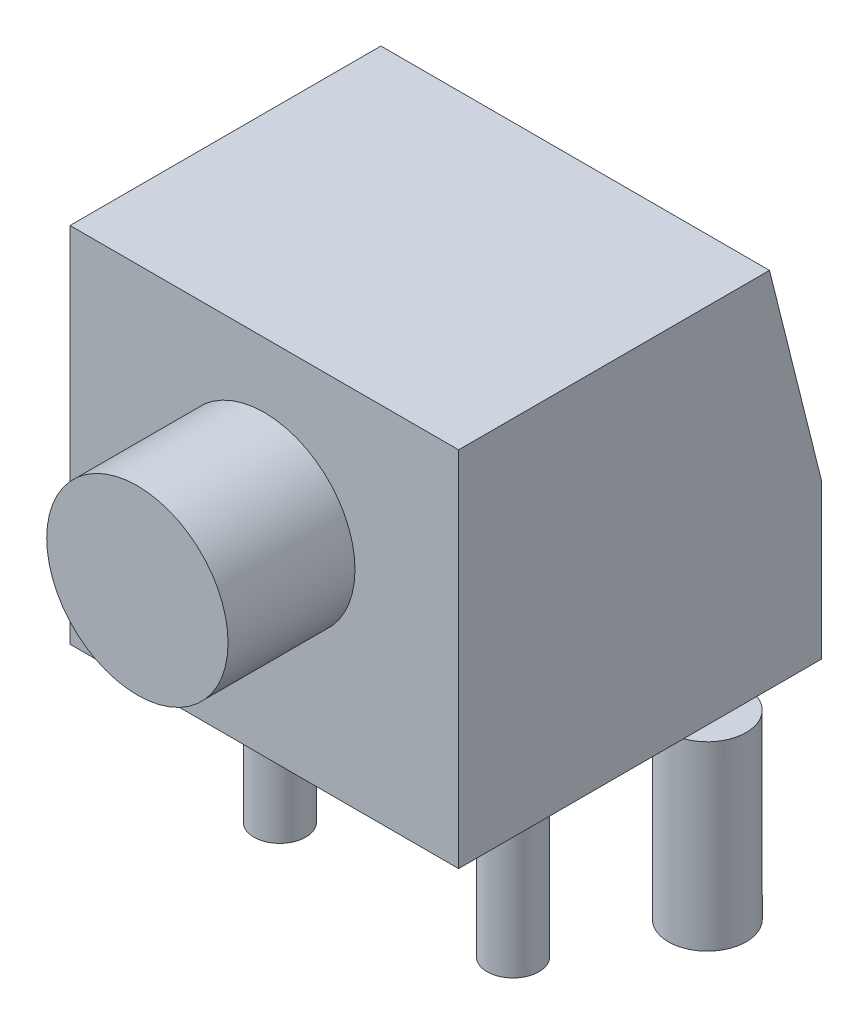
ISO-10303-21;
HEADER;
FILE_DESCRIPTION(('STEP AP214'),'2;1');
FILE_NAME('part.step','',(''),(''),'','','');
FILE_SCHEMA(('AUTOMOTIVE_DESIGN { 1 0 10303 214 1 1 1 1 }'));
ENDSEC;
DATA;
#1=APPLICATION_CONTEXT('core data for automotive mechanical design processes');
#2=APPLICATION_PROTOCOL_DEFINITION('international standard','automotive_design',2000,#1);
#3=PRODUCT_CONTEXT('',#1,'mechanical');
#4=PRODUCT('Part','Part','',(#3));
#5=PRODUCT_RELATED_PRODUCT_CATEGORY('part','',(#4));
#6=PRODUCT_DEFINITION_FORMATION('','',#4);
#7=PRODUCT_DEFINITION_CONTEXT('part definition',#1,'design');
#8=PRODUCT_DEFINITION('design','',#6,#7);
#9=PRODUCT_DEFINITION_SHAPE('','',#8);
#10=(LENGTH_UNIT() NAMED_UNIT(*) SI_UNIT(.MILLI.,.METRE.));
#11=(NAMED_UNIT(*) PLANE_ANGLE_UNIT() SI_UNIT($,.RADIAN.));
#12=(NAMED_UNIT(*) SI_UNIT($,.STERADIAN.) SOLID_ANGLE_UNIT());
#13=UNCERTAINTY_MEASURE_WITH_UNIT(LENGTH_MEASURE(1.E-05),#10,'distance_accuracy_value','');
#14=(GEOMETRIC_REPRESENTATION_CONTEXT(3) GLOBAL_UNCERTAINTY_ASSIGNED_CONTEXT((#13)) GLOBAL_UNIT_ASSIGNED_CONTEXT((#10,
#11,#12)) REPRESENTATION_CONTEXT('',''));
#15=CARTESIAN_POINT('',(0.,0.,0.));
#16=DIRECTION('',(0.,0.,1.));
#17=DIRECTION('',(1.,0.,0.));
#18=AXIS2_PLACEMENT_3D('',#15,#16,#17);
#19=CARTESIAN_POINT('',(3.75,0.,2.55));
#20=DIRECTION('',(0.,0.,-1.));
#21=DIRECTION('',(-1.,0.,0.));
#22=AXIS2_PLACEMENT_3D('',#19,#20,#21);
#23=PLANE('',#22);
#24=CARTESIAN_POINT('',(0.,4.,2.55));
#25=DIRECTION('',(0.,0.,1.));
#26=DIRECTION('',(1.,0.,0.));
#27=AXIS2_PLACEMENT_3D('',#24,#25,#26);
#28=CIRCLE('',#27,1.75);
#29=CARTESIAN_POINT('',(1.75,4.,2.55));
#30=VERTEX_POINT('',#29);
#31=EDGE_CURVE('E12',#30,#30,#28,.T.);
#32=ORIENTED_EDGE('',*,*,#31,.F.);
#33=EDGE_LOOP('',(#32));
#34=FACE_BOUND('',#33,.T.);
#35=DIRECTION('',(0.,-1.,0.));
#36=VECTOR('',#35,1.);
#37=CARTESIAN_POINT('',(-3.75,0.,2.55));
#38=LINE('',#37,#36);
#39=CARTESIAN_POINT('',(-3.75,7.,2.55));
#40=VERTEX_POINT('',#39);
#41=CARTESIAN_POINT('',(-3.75,0.,2.55));
#42=VERTEX_POINT('',#41);
#43=EDGE_CURVE('E132',#40,#42,#38,.T.);
#44=ORIENTED_EDGE('',*,*,#43,.T.);
#45=DIRECTION('',(-1.,0.,0.));
#46=VECTOR('',#45,1.);
#47=CARTESIAN_POINT('',(3.75,0.,2.55));
#48=LINE('',#47,#46);
#49=CARTESIAN_POINT('',(3.75,0.,2.55));
#50=VERTEX_POINT('',#49);
#51=EDGE_CURVE('E168',#50,#42,#48,.T.);
#52=ORIENTED_EDGE('',*,*,#51,.F.);
#53=DIRECTION('',(0.,-1.,0.));
#54=VECTOR('',#53,1.);
#55=CARTESIAN_POINT('',(3.75,0.,2.55));
#56=LINE('',#55,#54);
#57=CARTESIAN_POINT('',(3.75,7.,2.55));
#58=VERTEX_POINT('',#57);
#59=EDGE_CURVE('E115',#58,#50,#56,.T.);
#60=ORIENTED_EDGE('',*,*,#59,.F.);
#61=DIRECTION('',(-1.,0.,0.));
#62=VECTOR('',#61,1.);
#63=CARTESIAN_POINT('',(3.75,7.,2.55));
#64=LINE('',#63,#62);
#65=EDGE_CURVE('E170',#58,#40,#64,.T.);
#66=ORIENTED_EDGE('',*,*,#65,.T.);
#67=EDGE_LOOP('',(#44,#52,#60,#66));
#68=FACE_BOUND('',#67,.T.);
#69=ADVANCED_FACE('F36',(#34,#68),#23,.F.);
#70=CARTESIAN_POINT('',(3.75,0.,2.55));
#71=DIRECTION('',(0.,1.,0.));
#72=DIRECTION('',(0.,0.,1.));
#73=AXIS2_PLACEMENT_3D('',#70,#71,#72);
#74=PLANE('',#73);
#75=CARTESIAN_POINT('',(3.5,0.,-2.5));
#76=DIRECTION('',(0.,-1.,0.));
#77=DIRECTION('',(0.,0.,1.));
#78=AXIS2_PLACEMENT_3D('',#75,#76,#77);
#79=CIRCLE('',#78,0.75);
#80=CARTESIAN_POINT('',(3.75,0.,-1.79289321881345));
#81=VERTEX_POINT('',#80);
#82=CARTESIAN_POINT('',(3.75,0.,-3.20710678118655));
#83=VERTEX_POINT('',#82);
#84=EDGE_CURVE('E103',#81,#83,#79,.T.);
#85=ORIENTED_EDGE('',*,*,#84,.F.);
#86=DIRECTION('',(0.,0.,-1.));
#87=VECTOR('',#86,1.);
#88=CARTESIAN_POINT('',(3.75,0.,2.55));
#89=LINE('',#88,#87);
#90=EDGE_CURVE('E97',#50,#81,#89,.T.);
#91=ORIENTED_EDGE('',*,*,#90,.F.);
#92=ORIENTED_EDGE('',*,*,#51,.T.);
#93=DIRECTION('',(0.,0.,-1.));
#94=VECTOR('',#93,1.);
#95=CARTESIAN_POINT('',(-3.75,0.,2.55));
#96=LINE('',#95,#94);
#97=CARTESIAN_POINT('',(-3.75,0.,-1.79289321881345));
#98=VERTEX_POINT('',#97);
#99=EDGE_CURVE('E177',#42,#98,#96,.T.);
#100=ORIENTED_EDGE('',*,*,#99,.T.);
#101=CARTESIAN_POINT('',(-3.5,0.,-2.5));
#102=DIRECTION('',(0.,-1.,0.));
#103=DIRECTION('',(0.,0.,-1.));
#104=AXIS2_PLACEMENT_3D('',#101,#102,#103);
#105=CIRCLE('',#104,0.75);
#106=CARTESIAN_POINT('',(-3.75,0.,-3.20710678118655));
#107=VERTEX_POINT('',#106);
#108=EDGE_CURVE('E58',#107,#98,#105,.T.);
#109=ORIENTED_EDGE('',*,*,#108,.F.);
#110=CARTESIAN_POINT('',(-3.75,0.,-4.45));
#111=VERTEX_POINT('',#110);
#112=EDGE_CURVE('E173',#107,#111,#96,.T.);
#113=ORIENTED_EDGE('',*,*,#112,.T.);
#114=DIRECTION('',(-1.,0.,0.));
#115=VECTOR('',#114,1.);
#116=CARTESIAN_POINT('',(3.75,0.,-4.45));
#117=LINE('',#116,#115);
#118=CARTESIAN_POINT('',(3.75,0.,-4.45));
#119=VERTEX_POINT('',#118);
#120=EDGE_CURVE('E192',#119,#111,#117,.T.);
#121=ORIENTED_EDGE('',*,*,#120,.F.);
#122=EDGE_CURVE('E98',#83,#119,#89,.T.);
#123=ORIENTED_EDGE('',*,*,#122,.F.);
#124=EDGE_LOOP('',(#85,#91,#92,#100,#109,#113,#121,#123));
#125=FACE_BOUND('',#124,.T.);
#126=CARTESIAN_POINT('',(2.25,0.,0.));
#127=DIRECTION('',(0.,1.,0.));
#128=DIRECTION('',(0.,0.,1.));
#129=AXIS2_PLACEMENT_3D('',#126,#127,#128);
#130=CIRCLE('',#129,0.5);
#131=CARTESIAN_POINT('',(2.25,0.,0.5));
#132=VERTEX_POINT('',#131);
#133=EDGE_CURVE('E39',#132,#132,#130,.F.);
#134=ORIENTED_EDGE('',*,*,#133,.F.);
#135=EDGE_LOOP('',(#134));
#136=FACE_BOUND('',#135,.T.);
#137=CARTESIAN_POINT('',(-2.25,0.,0.));
#138=DIRECTION('',(0.,1.,0.));
#139=DIRECTION('',(0.,0.,1.));
#140=AXIS2_PLACEMENT_3D('',#137,#138,#139);
#141=CIRCLE('',#140,0.5);
#142=CARTESIAN_POINT('',(-2.25,0.,0.5));
#143=VERTEX_POINT('',#142);
#144=EDGE_CURVE('E195',#143,#143,#141,.F.);
#145=ORIENTED_EDGE('',*,*,#144,.F.);
#146=EDGE_LOOP('',(#145));
#147=FACE_BOUND('',#146,.T.);
#148=ADVANCED_FACE('F107',(#125,#136,#147),#74,.F.);
#149=CARTESIAN_POINT('',(3.75,0.,-4.45));
#150=DIRECTION('',(0.,0.,1.));
#151=DIRECTION('',(1.,0.,0.));
#152=AXIS2_PLACEMENT_3D('',#149,#150,#151);
#153=PLANE('',#152);
#154=DIRECTION('',(0.,1.,0.));
#155=VECTOR('',#154,1.);
#156=CARTESIAN_POINT('',(-3.75,0.,-4.45));
#157=LINE('',#156,#155);
#158=CARTESIAN_POINT('',(-3.75,3.,-4.45));
#159=VERTEX_POINT('',#158);
#160=EDGE_CURVE('E182',#111,#159,#157,.T.);
#161=ORIENTED_EDGE('',*,*,#160,.T.);
#162=DIRECTION('',(-1.,0.,0.));
#163=VECTOR('',#162,1.);
#164=CARTESIAN_POINT('',(3.75,3.,-4.45));
#165=LINE('',#164,#163);
#166=CARTESIAN_POINT('',(3.75,3.,-4.45));
#167=VERTEX_POINT('',#166);
#168=EDGE_CURVE('E189',#167,#159,#165,.T.);
#169=ORIENTED_EDGE('',*,*,#168,.F.);
#170=DIRECTION('',(0.,1.,0.));
#171=VECTOR('',#170,1.);
#172=CARTESIAN_POINT('',(3.75,0.,-4.45));
#173=LINE('',#172,#171);
#174=EDGE_CURVE('E117',#119,#167,#173,.T.);
#175=ORIENTED_EDGE('',*,*,#174,.F.);
#176=ORIENTED_EDGE('',*,*,#120,.T.);
#177=EDGE_LOOP('',(#161,#169,#175,#176));
#178=FACE_BOUND('',#177,.T.);
#179=ADVANCED_FACE('F162',(#178),#153,.F.);
#180=CARTESIAN_POINT('',(3.75,3.,-4.45));
#181=DIRECTION('',(0.,-0.242535625036333,0.970142500145332));
#182=DIRECTION('',(0.,-0.970142500145332,-0.242535625036333));
#183=AXIS2_PLACEMENT_3D('',#180,#181,#182);
#184=PLANE('',#183);
#185=DIRECTION('',(0.,0.970142500145332,0.242535625036333));
#186=VECTOR('',#185,1.);
#187=CARTESIAN_POINT('',(-3.75,3.,-4.45));
#188=LINE('',#187,#186);
#189=CARTESIAN_POINT('',(-3.75,7.,-3.45));
#190=VERTEX_POINT('',#189);
#191=EDGE_CURVE('E122',#159,#190,#188,.T.);
#192=ORIENTED_EDGE('',*,*,#191,.T.);
#193=DIRECTION('',(-1.,0.,0.));
#194=VECTOR('',#193,1.);
#195=CARTESIAN_POINT('',(3.75,7.,-3.45));
#196=LINE('',#195,#194);
#197=CARTESIAN_POINT('',(3.75,7.,-3.45));
#198=VERTEX_POINT('',#197);
#199=EDGE_CURVE('E186',#198,#190,#196,.T.);
#200=ORIENTED_EDGE('',*,*,#199,.F.);
#201=DIRECTION('',(0.,0.970142500145332,0.242535625036333));
#202=VECTOR('',#201,1.);
#203=CARTESIAN_POINT('',(3.75,3.,-4.45));
#204=LINE('',#203,#202);
#205=EDGE_CURVE('E118',#167,#198,#204,.T.);
#206=ORIENTED_EDGE('',*,*,#205,.F.);
#207=ORIENTED_EDGE('',*,*,#168,.T.);
#208=EDGE_LOOP('',(#192,#200,#206,#207));
#209=FACE_BOUND('',#208,.T.);
#210=ADVANCED_FACE('F217',(#209),#184,.F.);
#211=CARTESIAN_POINT('',(3.75,7.,2.55));
#212=DIRECTION('',(0.,-1.,0.));
#213=DIRECTION('',(0.,0.,-1.));
#214=AXIS2_PLACEMENT_3D('',#211,#212,#213);
#215=PLANE('',#214);
#216=DIRECTION('',(0.,0.,1.));
#217=VECTOR('',#216,1.);
#218=CARTESIAN_POINT('',(-3.75,7.,2.55));
#219=LINE('',#218,#217);
#220=EDGE_CURVE('E121',#190,#40,#219,.T.);
#221=ORIENTED_EDGE('',*,*,#220,.T.);
#222=ORIENTED_EDGE('',*,*,#65,.F.);
#223=DIRECTION('',(0.,0.,1.));
#224=VECTOR('',#223,1.);
#225=CARTESIAN_POINT('',(3.75,7.,2.55));
#226=LINE('',#225,#224);
#227=EDGE_CURVE('E179',#198,#58,#226,.T.);
#228=ORIENTED_EDGE('',*,*,#227,.F.);
#229=ORIENTED_EDGE('',*,*,#199,.T.);
#230=EDGE_LOOP('',(#221,#222,#228,#229));
#231=FACE_BOUND('',#230,.T.);
#232=ADVANCED_FACE('F219',(#231),#215,.F.);
#233=CARTESIAN_POINT('',(3.75,0.,0.));
#234=DIRECTION('',(-1.,0.,0.));
#235=DIRECTION('',(0.,0.,1.));
#236=AXIS2_PLACEMENT_3D('',#233,#234,#235);
#237=PLANE('',#236);
#238=ORIENTED_EDGE('',*,*,#59,.T.);
#239=ORIENTED_EDGE('',*,*,#90,.T.);
#240=EDGE_CURVE('E93',#81,#83,#89,.T.);
#241=ORIENTED_EDGE('',*,*,#240,.T.);
#242=ORIENTED_EDGE('',*,*,#122,.T.);
#243=ORIENTED_EDGE('',*,*,#174,.T.);
#244=ORIENTED_EDGE('',*,*,#205,.T.);
#245=ORIENTED_EDGE('',*,*,#227,.T.);
#246=EDGE_LOOP('',(#238,#239,#241,#242,#243,#244,#245));
#247=FACE_BOUND('',#246,.T.);
#248=ADVANCED_FACE('F113',(#247),#237,.F.);
#249=CARTESIAN_POINT('',(-3.75,0.,0.));
#250=DIRECTION('',(-1.,0.,0.));
#251=DIRECTION('',(0.,0.,1.));
#252=AXIS2_PLACEMENT_3D('',#249,#250,#251);
#253=PLANE('',#252);
#254=ORIENTED_EDGE('',*,*,#43,.F.);
#255=ORIENTED_EDGE('',*,*,#220,.F.);
#256=ORIENTED_EDGE('',*,*,#191,.F.);
#257=ORIENTED_EDGE('',*,*,#160,.F.);
#258=ORIENTED_EDGE('',*,*,#112,.F.);
#259=EDGE_CURVE('E175',#98,#107,#96,.T.);
#260=ORIENTED_EDGE('',*,*,#259,.F.);
#261=ORIENTED_EDGE('',*,*,#99,.F.);
#262=EDGE_LOOP('',(#254,#255,#256,#257,#258,#260,#261));
#263=FACE_BOUND('',#262,.T.);
#264=ADVANCED_FACE('F207',(#263),#253,.T.);
#265=CARTESIAN_POINT('',(-3.5,0.,-2.5));
#266=DIRECTION('',(0.,-1.,0.));
#267=DIRECTION('',(0.,0.,-1.));
#268=AXIS2_PLACEMENT_3D('',#265,#266,#267);
#269=PLANE('',#268);
#270=EDGE_CURVE('E125',#98,#107,#105,.T.);
#271=ORIENTED_EDGE('',*,*,#270,.F.);
#272=ORIENTED_EDGE('',*,*,#259,.T.);
#273=EDGE_LOOP('',(#271,#272));
#274=FACE_BOUND('',#273,.T.);
#275=ADVANCED_FACE('F205',(#274),#269,.F.);
#276=CARTESIAN_POINT('',(-3.5,-3.5,-2.5));
#277=DIRECTION('',(0.,1.,0.));
#278=DIRECTION('',(0.,0.,1.));
#279=AXIS2_PLACEMENT_3D('',#276,#277,#278);
#280=CYLINDRICAL_SURFACE('',#279,0.75);
#281=CARTESIAN_POINT('',(-3.5,-3.5,-2.5));
#282=DIRECTION('',(0.,-1.,0.));
#283=DIRECTION('',(0.,0.,-1.));
#284=AXIS2_PLACEMENT_3D('',#281,#282,#283);
#285=CIRCLE('',#284,0.75);
#286=CARTESIAN_POINT('',(-3.5,-3.5,-3.25));
#287=VERTEX_POINT('',#286);
#288=EDGE_CURVE('E128',#287,#287,#285,.T.);
#289=ORIENTED_EDGE('',*,*,#288,.F.);
#290=EDGE_LOOP('',(#289));
#291=FACE_BOUND('',#290,.T.);
#292=ORIENTED_EDGE('',*,*,#270,.T.);
#293=ORIENTED_EDGE('',*,*,#108,.T.);
#294=EDGE_LOOP('',(#292,#293));
#295=FACE_BOUND('',#294,.T.);
#296=ADVANCED_FACE('F202',(#291,#295),#280,.T.);
#297=CARTESIAN_POINT('',(-3.5,-3.5,-2.5));
#298=DIRECTION('',(0.,-1.,0.));
#299=DIRECTION('',(0.,0.,-1.));
#300=AXIS2_PLACEMENT_3D('',#297,#298,#299);
#301=PLANE('',#300);
#302=ORIENTED_EDGE('',*,*,#288,.T.);
#303=EDGE_LOOP('',(#302));
#304=FACE_BOUND('',#303,.T.);
#305=ADVANCED_FACE('F278',(#304),#301,.T.);
#306=CARTESIAN_POINT('',(-2.25,-3.5,0.));
#307=DIRECTION('',(0.,1.,0.));
#308=DIRECTION('',(0.,0.,1.));
#309=AXIS2_PLACEMENT_3D('',#306,#307,#308);
#310=CYLINDRICAL_SURFACE('',#309,0.5);
#311=CARTESIAN_POINT('',(-2.25,-3.5,0.));
#312=DIRECTION('',(0.,-1.,0.));
#313=DIRECTION('',(0.,0.,-1.));
#314=AXIS2_PLACEMENT_3D('',#311,#312,#313);
#315=CIRCLE('',#314,0.5);
#316=CARTESIAN_POINT('',(-2.25,-3.5,-0.5));
#317=VERTEX_POINT('',#316);
#318=EDGE_CURVE('E129',#317,#317,#315,.T.);
#319=ORIENTED_EDGE('',*,*,#318,.F.);
#320=EDGE_LOOP('',(#319));
#321=FACE_BOUND('',#320,.T.);
#322=ORIENTED_EDGE('',*,*,#144,.T.);
#323=EDGE_LOOP('',(#322));
#324=FACE_BOUND('',#323,.T.);
#325=ADVANCED_FACE('F288',(#321,#324),#310,.T.);
#326=CARTESIAN_POINT('',(-2.25,-3.5,0.));
#327=DIRECTION('',(0.,-1.,0.));
#328=DIRECTION('',(0.,0.,-1.));
#329=AXIS2_PLACEMENT_3D('',#326,#327,#328);
#330=PLANE('',#329);
#331=ORIENTED_EDGE('',*,*,#318,.T.);
#332=EDGE_LOOP('',(#331));
#333=FACE_BOUND('',#332,.T.);
#334=ADVANCED_FACE('F298',(#333),#330,.T.);
#335=CARTESIAN_POINT('',(2.25,-3.5,0.));
#336=DIRECTION('',(0.,1.,0.));
#337=DIRECTION('',(0.,0.,1.));
#338=AXIS2_PLACEMENT_3D('',#335,#336,#337);
#339=CYLINDRICAL_SURFACE('',#338,0.5);
#340=CARTESIAN_POINT('',(2.25,-3.5,0.));
#341=DIRECTION('',(0.,-1.,0.));
#342=DIRECTION('',(0.,0.,1.));
#343=AXIS2_PLACEMENT_3D('',#340,#341,#342);
#344=CIRCLE('',#343,0.5);
#345=CARTESIAN_POINT('',(2.25,-3.5,0.5));
#346=VERTEX_POINT('',#345);
#347=EDGE_CURVE('E135',#346,#346,#344,.T.);
#348=ORIENTED_EDGE('',*,*,#347,.F.);
#349=EDGE_LOOP('',(#348));
#350=FACE_BOUND('',#349,.T.);
#351=ORIENTED_EDGE('',*,*,#133,.T.);
#352=EDGE_LOOP('',(#351));
#353=FACE_BOUND('',#352,.T.);
#354=ADVANCED_FACE('F308',(#350,#353),#339,.T.);
#355=CARTESIAN_POINT('',(2.25,-3.5,0.));
#356=DIRECTION('',(0.,1.,0.));
#357=DIRECTION('',(0.,0.,1.));
#358=AXIS2_PLACEMENT_3D('',#355,#356,#357);
#359=PLANE('',#358);
#360=ORIENTED_EDGE('',*,*,#347,.T.);
#361=EDGE_LOOP('',(#360));
#362=FACE_BOUND('',#361,.T.);
#363=ADVANCED_FACE('F318',(#362),#359,.F.);
#364=CARTESIAN_POINT('',(3.5,0.,-2.5));
#365=DIRECTION('',(0.,1.,0.));
#366=DIRECTION('',(0.,0.,1.));
#367=AXIS2_PLACEMENT_3D('',#364,#365,#366);
#368=PLANE('',#367);
#369=ORIENTED_EDGE('',*,*,#240,.F.);
#370=EDGE_CURVE('E50',#83,#81,#79,.T.);
#371=ORIENTED_EDGE('',*,*,#370,.F.);
#372=EDGE_LOOP('',(#369,#371));
#373=FACE_BOUND('',#372,.T.);
#374=ADVANCED_FACE('F94',(#373),#368,.T.);
#375=CARTESIAN_POINT('',(3.5,-3.5,-2.5));
#376=DIRECTION('',(0.,1.,0.));
#377=DIRECTION('',(0.,0.,1.));
#378=AXIS2_PLACEMENT_3D('',#375,#376,#377);
#379=CYLINDRICAL_SURFACE('',#378,0.75);
#380=CARTESIAN_POINT('',(3.5,-3.5,-2.5));
#381=DIRECTION('',(0.,-1.,0.));
#382=DIRECTION('',(0.,0.,1.));
#383=AXIS2_PLACEMENT_3D('',#380,#381,#382);
#384=CIRCLE('',#383,0.75);
#385=CARTESIAN_POINT('',(3.5,-3.5,-1.75));
#386=VERTEX_POINT('',#385);
#387=EDGE_CURVE('E105',#386,#386,#384,.T.);
#388=ORIENTED_EDGE('',*,*,#387,.F.);
#389=EDGE_LOOP('',(#388));
#390=FACE_BOUND('',#389,.T.);
#391=ORIENTED_EDGE('',*,*,#370,.T.);
#392=ORIENTED_EDGE('',*,*,#84,.T.);
#393=EDGE_LOOP('',(#391,#392));
#394=FACE_BOUND('',#393,.T.);
#395=ADVANCED_FACE('F102',(#390,#394),#379,.T.);
#396=CARTESIAN_POINT('',(3.5,-3.5,-2.5));
#397=DIRECTION('',(0.,1.,0.));
#398=DIRECTION('',(0.,0.,1.));
#399=AXIS2_PLACEMENT_3D('',#396,#397,#398);
#400=PLANE('',#399);
#401=ORIENTED_EDGE('',*,*,#387,.T.);
#402=EDGE_LOOP('',(#401));
#403=FACE_BOUND('',#402,.T.);
#404=ADVANCED_FACE('F147',(#403),#400,.F.);
#405=CARTESIAN_POINT('',(0.,4.,14.9497474683058));
#406=DIRECTION('',(0.,0.,-1.));
#407=DIRECTION('',(-1.,0.,0.));
#408=AXIS2_PLACEMENT_3D('',#405,#406,#407);
#409=CYLINDRICAL_SURFACE('',#408,1.75);
#410=ORIENTED_EDGE('',*,*,#31,.T.);
#411=EDGE_LOOP('',(#410));
#412=FACE_BOUND('',#411,.T.);
#413=CARTESIAN_POINT('',(0.,4.,5.));
#414=DIRECTION('',(0.,0.,1.));
#415=DIRECTION('',(1.,0.,0.));
#416=AXIS2_PLACEMENT_3D('',#413,#414,#415);
#417=CIRCLE('',#416,1.75);
#418=CARTESIAN_POINT('',(1.75,4.,5.));
#419=VERTEX_POINT('',#418);
#420=EDGE_CURVE('E112',#419,#419,#417,.T.);
#421=ORIENTED_EDGE('',*,*,#420,.F.);
#422=EDGE_LOOP('',(#421));
#423=FACE_BOUND('',#422,.T.);
#424=ADVANCED_FACE('F145',(#412,#423),#409,.T.);
#425=CARTESIAN_POINT('',(0.,0.,5.));
#426=DIRECTION('',(0.,0.,1.));
#427=DIRECTION('',(1.,0.,0.));
#428=AXIS2_PLACEMENT_3D('',#425,#426,#427);
#429=PLANE('',#428);
#430=ORIENTED_EDGE('',*,*,#420,.T.);
#431=EDGE_LOOP('',(#430));
#432=FACE_BOUND('',#431,.T.);
#433=ADVANCED_FACE('F143',(#432),#429,.T.);
#434=CLOSED_SHELL('',(#69,#148,#179,#210,#232,#248,#264,#275,#296,#305,#325,#334,#354,#363,#374,
#395,#404,#424,#433));
#435=MANIFOLD_SOLID_BREP('B2',#434);
#436=ADVANCED_BREP_SHAPE_REPRESENTATION('',(#18,#435),#14);
#437=SHAPE_DEFINITION_REPRESENTATION(#9,#436);
ENDSEC;
END-ISO-10303-21;
